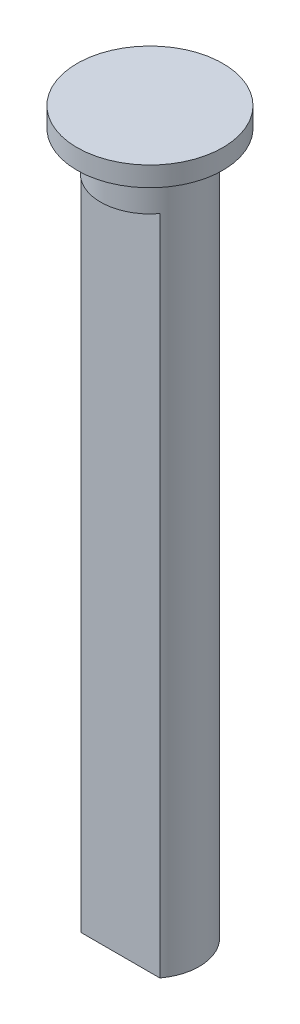
ISO-10303-21;
HEADER;
FILE_DESCRIPTION(('STEP AP214'),'2;1');
FILE_NAME('part.step','',(''),(''),'','','');
FILE_SCHEMA(('AUTOMOTIVE_DESIGN { 1 0 10303 214 1 1 1 1 }'));
ENDSEC;
DATA;
#1=APPLICATION_CONTEXT('core data for automotive mechanical design processes');
#2=APPLICATION_PROTOCOL_DEFINITION('international standard','automotive_design',2000,#1);
#3=PRODUCT_CONTEXT('',#1,'mechanical');
#4=PRODUCT('Part','Part','',(#3));
#5=PRODUCT_RELATED_PRODUCT_CATEGORY('part','',(#4));
#6=PRODUCT_DEFINITION_FORMATION('','',#4);
#7=PRODUCT_DEFINITION_CONTEXT('part definition',#1,'design');
#8=PRODUCT_DEFINITION('design','',#6,#7);
#9=PRODUCT_DEFINITION_SHAPE('','',#8);
#10=(LENGTH_UNIT() NAMED_UNIT(*) SI_UNIT(.MILLI.,.METRE.));
#11=(NAMED_UNIT(*) PLANE_ANGLE_UNIT() SI_UNIT($,.RADIAN.));
#12=(NAMED_UNIT(*) SI_UNIT($,.STERADIAN.) SOLID_ANGLE_UNIT());
#13=UNCERTAINTY_MEASURE_WITH_UNIT(LENGTH_MEASURE(1.E-05),#10,'distance_accuracy_value','');
#14=(GEOMETRIC_REPRESENTATION_CONTEXT(3) GLOBAL_UNCERTAINTY_ASSIGNED_CONTEXT((#13)) GLOBAL_UNIT_ASSIGNED_CONTEXT((#10,
#11,#12)) REPRESENTATION_CONTEXT('',''));
#15=CARTESIAN_POINT('',(0.,0.,0.));
#16=DIRECTION('',(0.,0.,1.));
#17=DIRECTION('',(1.,0.,0.));
#18=AXIS2_PLACEMENT_3D('',#15,#16,#17);
#19=CARTESIAN_POINT('',(0.,27.8,0.));
#20=DIRECTION('',(0.,-1.,0.));
#21=DIRECTION('',(0.,0.,-1.));
#22=AXIS2_PLACEMENT_3D('',#19,#20,#21);
#23=CYLINDRICAL_SURFACE('',#22,2.5);
#24=DIRECTION('',(0.,-1.,0.));
#25=VECTOR('',#24,1.);
#26=CARTESIAN_POINT('',(2.,27.8,1.5));
#27=LINE('',#26,#25);
#28=CARTESIAN_POINT('',(2.,27.8,1.5));
#29=VERTEX_POINT('',#28);
#30=CARTESIAN_POINT('',(2.,-5.8,1.5));
#31=VERTEX_POINT('',#30);
#32=EDGE_CURVE('E47',#29,#31,#27,.T.);
#33=ORIENTED_EDGE('',*,*,#32,.T.);
#34=CARTESIAN_POINT('',(0.,-5.8,0.));
#35=DIRECTION('',(0.,-1.,0.));
#36=DIRECTION('',(0.,0.,-1.));
#37=AXIS2_PLACEMENT_3D('',#34,#35,#36);
#38=CIRCLE('',#37,2.5);
#39=CARTESIAN_POINT('',(-2.,-5.8,1.5));
#40=VERTEX_POINT('',#39);
#41=EDGE_CURVE('E66',#40,#31,#38,.T.);
#42=ORIENTED_EDGE('',*,*,#41,.F.);
#43=DIRECTION('',(0.,-1.,0.));
#44=VECTOR('',#43,1.);
#45=CARTESIAN_POINT('',(-2.,27.8,1.5));
#46=LINE('',#45,#44);
#47=CARTESIAN_POINT('',(-2.,27.8,1.5));
#48=VERTEX_POINT('',#47);
#49=EDGE_CURVE('E11',#48,#40,#46,.T.);
#50=ORIENTED_EDGE('',*,*,#49,.F.);
#51=CARTESIAN_POINT('',(0.,27.8,0.));
#52=DIRECTION('',(0.,1.,0.));
#53=DIRECTION('',(0.,0.,1.));
#54=AXIS2_PLACEMENT_3D('',#51,#52,#53);
#55=CIRCLE('',#54,2.5);
#56=EDGE_CURVE('E68',#48,#29,#55,.T.);
#57=ORIENTED_EDGE('',*,*,#56,.T.);
#58=EDGE_LOOP('',(#33,#42,#50,#57));
#59=FACE_BOUND('',#58,.T.);
#60=CARTESIAN_POINT('',(0.,29.8,0.));
#61=DIRECTION('',(0.,1.,0.));
#62=DIRECTION('',(0.,0.,1.));
#63=AXIS2_PLACEMENT_3D('',#60,#61,#62);
#64=CIRCLE('',#63,2.5);
#65=CARTESIAN_POINT('',(0.,29.8,2.5));
#66=VERTEX_POINT('',#65);
#67=EDGE_CURVE('E88',#66,#66,#64,.T.);
#68=ORIENTED_EDGE('',*,*,#67,.F.);
#69=EDGE_LOOP('',(#68));
#70=FACE_BOUND('',#69,.T.);
#71=ADVANCED_FACE('F39',(#59,#70),#23,.T.);
#72=CARTESIAN_POINT('',(-2.,27.8,1.5));
#73=DIRECTION('',(0.,0.,-1.));
#74=DIRECTION('',(-1.,0.,0.));
#75=AXIS2_PLACEMENT_3D('',#72,#73,#74);
#76=PLANE('',#75);
#77=ORIENTED_EDGE('',*,*,#49,.T.);
#78=DIRECTION('',(-1.,0.,0.));
#79=VECTOR('',#78,1.);
#80=CARTESIAN_POINT('',(-2.,-5.8,1.5));
#81=LINE('',#80,#79);
#82=EDGE_CURVE('E71',#31,#40,#81,.T.);
#83=ORIENTED_EDGE('',*,*,#82,.F.);
#84=ORIENTED_EDGE('',*,*,#32,.F.);
#85=DIRECTION('',(1.,0.,0.));
#86=VECTOR('',#85,1.);
#87=CARTESIAN_POINT('',(-2.,27.8,1.5));
#88=LINE('',#87,#86);
#89=EDGE_CURVE('E53',#48,#29,#88,.T.);
#90=ORIENTED_EDGE('',*,*,#89,.F.);
#91=EDGE_LOOP('',(#77,#83,#84,#90));
#92=FACE_BOUND('',#91,.T.);
#93=ADVANCED_FACE('F72',(#92),#76,.F.);
#94=CARTESIAN_POINT('',(0.,27.8,0.));
#95=DIRECTION('',(0.,1.,0.));
#96=DIRECTION('',(0.,0.,1.));
#97=AXIS2_PLACEMENT_3D('',#94,#95,#96);
#98=PLANE('',#97);
#99=ORIENTED_EDGE('',*,*,#56,.F.);
#100=ORIENTED_EDGE('',*,*,#89,.T.);
#101=EDGE_LOOP('',(#99,#100));
#102=FACE_BOUND('',#101,.T.);
#103=ADVANCED_FACE('F96',(#102),#98,.F.);
#104=CARTESIAN_POINT('',(0.,30.8,0.));
#105=DIRECTION('',(0.,-1.,0.));
#106=DIRECTION('',(0.,0.,-1.));
#107=AXIS2_PLACEMENT_3D('',#104,#105,#106);
#108=CYLINDRICAL_SURFACE('',#107,3.7);
#109=CARTESIAN_POINT('',(0.,30.8,0.));
#110=DIRECTION('',(0.,1.,0.));
#111=DIRECTION('',(0.,0.,1.));
#112=AXIS2_PLACEMENT_3D('',#109,#110,#111);
#113=CIRCLE('',#112,3.7);
#114=CARTESIAN_POINT('',(0.,30.8,3.7));
#115=VERTEX_POINT('',#114);
#116=EDGE_CURVE('E81',#115,#115,#113,.T.);
#117=ORIENTED_EDGE('',*,*,#116,.F.);
#118=EDGE_LOOP('',(#117));
#119=FACE_BOUND('',#118,.T.);
#120=CARTESIAN_POINT('',(0.,29.8,0.));
#121=DIRECTION('',(0.,1.,0.));
#122=DIRECTION('',(0.,0.,1.));
#123=AXIS2_PLACEMENT_3D('',#120,#121,#122);
#124=CIRCLE('',#123,3.7);
#125=CARTESIAN_POINT('',(0.,29.8,3.7));
#126=VERTEX_POINT('',#125);
#127=EDGE_CURVE('E75',#126,#126,#124,.T.);
#128=ORIENTED_EDGE('',*,*,#127,.T.);
#129=EDGE_LOOP('',(#128));
#130=FACE_BOUND('',#129,.T.);
#131=ADVANCED_FACE('F98',(#119,#130),#108,.T.);
#132=CARTESIAN_POINT('',(0.,30.8,0.));
#133=DIRECTION('',(0.,1.,0.));
#134=DIRECTION('',(0.,0.,1.));
#135=AXIS2_PLACEMENT_3D('',#132,#133,#134);
#136=PLANE('',#135);
#137=ORIENTED_EDGE('',*,*,#116,.T.);
#138=EDGE_LOOP('',(#137));
#139=FACE_BOUND('',#138,.T.);
#140=ADVANCED_FACE('F104',(#139),#136,.T.);
#141=CARTESIAN_POINT('',(0.,29.8,0.));
#142=DIRECTION('',(0.,1.,0.));
#143=DIRECTION('',(0.,0.,1.));
#144=AXIS2_PLACEMENT_3D('',#141,#142,#143);
#145=PLANE('',#144);
#146=ORIENTED_EDGE('',*,*,#67,.T.);
#147=EDGE_LOOP('',(#146));
#148=FACE_BOUND('',#147,.T.);
#149=ORIENTED_EDGE('',*,*,#127,.F.);
#150=EDGE_LOOP('',(#149));
#151=FACE_BOUND('',#150,.T.);
#152=ADVANCED_FACE('F124',(#148,#151),#145,.F.);
#153=CARTESIAN_POINT('',(0.,-5.8,0.));
#154=DIRECTION('',(0.,-1.,0.));
#155=DIRECTION('',(0.,0.,-1.));
#156=AXIS2_PLACEMENT_3D('',#153,#154,#155);
#157=PLANE('',#156);
#158=ORIENTED_EDGE('',*,*,#41,.T.);
#159=ORIENTED_EDGE('',*,*,#82,.T.);
#160=EDGE_LOOP('',(#158,#159));
#161=FACE_BOUND('',#160,.T.);
#162=ADVANCED_FACE('F77',(#161),#157,.T.);
#163=CLOSED_SHELL('',(#71,#93,#103,#131,#140,#152,#162));
#164=MANIFOLD_SOLID_BREP('B2',#163);
#165=ADVANCED_BREP_SHAPE_REPRESENTATION('',(#18,#164),#14);
#166=SHAPE_DEFINITION_REPRESENTATION(#9,#165);
ENDSEC;
END-ISO-10303-21;
